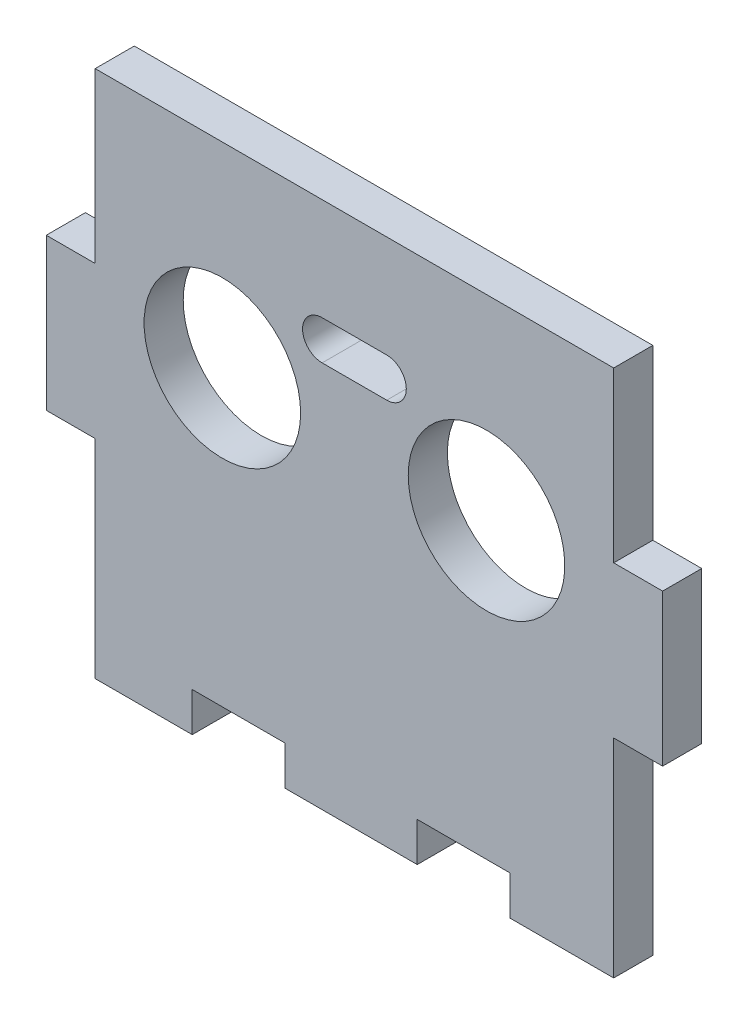
ISO-10303-21;
HEADER;
FILE_DESCRIPTION(('STEP AP214'),'2;1');
FILE_NAME('part.step','',(''),(''),'','','');
FILE_SCHEMA(('AUTOMOTIVE_DESIGN { 1 0 10303 214 1 1 1 1 }'));
ENDSEC;
DATA;
#1=APPLICATION_CONTEXT('core data for automotive mechanical design processes');
#2=APPLICATION_PROTOCOL_DEFINITION('international standard','automotive_design',2000,#1);
#3=PRODUCT_CONTEXT('',#1,'mechanical');
#4=PRODUCT('Part','Part','',(#3));
#5=PRODUCT_RELATED_PRODUCT_CATEGORY('part','',(#4));
#6=PRODUCT_DEFINITION_FORMATION('','',#4);
#7=PRODUCT_DEFINITION_CONTEXT('part definition',#1,'design');
#8=PRODUCT_DEFINITION('design','',#6,#7);
#9=PRODUCT_DEFINITION_SHAPE('','',#8);
#10=(LENGTH_UNIT() NAMED_UNIT(*) SI_UNIT(.MILLI.,.METRE.));
#11=(NAMED_UNIT(*) PLANE_ANGLE_UNIT() SI_UNIT($,.RADIAN.));
#12=(NAMED_UNIT(*) SI_UNIT($,.STERADIAN.) SOLID_ANGLE_UNIT());
#13=UNCERTAINTY_MEASURE_WITH_UNIT(LENGTH_MEASURE(1.E-05),#10,'distance_accuracy_value','');
#14=(GEOMETRIC_REPRESENTATION_CONTEXT(3) GLOBAL_UNCERTAINTY_ASSIGNED_CONTEXT((#13)) GLOBAL_UNIT_ASSIGNED_CONTEXT((#10,
#11,#12)) REPRESENTATION_CONTEXT('',''));
#15=CARTESIAN_POINT('',(0.,0.,0.));
#16=DIRECTION('',(0.,0.,1.));
#17=DIRECTION('',(1.,0.,0.));
#18=AXIS2_PLACEMENT_3D('',#15,#16,#17);
#19=CARTESIAN_POINT('',(0.,0.,4.));
#20=DIRECTION('',(0.,0.,-1.));
#21=DIRECTION('',(-1.,0.,0.));
#22=AXIS2_PLACEMENT_3D('',#19,#20,#21);
#23=PLANE('',#22);
#24=DIRECTION('',(-1.,0.,0.));
#25=VECTOR('',#24,1.);
#26=CARTESIAN_POINT('',(58.,36.75,4.));
#27=LINE('',#26,#25);
#28=CARTESIAN_POINT('',(63.,36.75,4.));
#29=VERTEX_POINT('',#28);
#30=CARTESIAN_POINT('',(58.,36.75,4.));
#31=VERTEX_POINT('',#30);
#32=EDGE_CURVE('E251',#29,#31,#27,.T.);
#33=ORIENTED_EDGE('',*,*,#32,.T.);
#34=DIRECTION('',(0.,1.,0.));
#35=VECTOR('',#34,1.);
#36=CARTESIAN_POINT('',(58.,54.,4.));
#37=LINE('',#36,#35);
#38=CARTESIAN_POINT('',(58.,54.,4.));
#39=VERTEX_POINT('',#38);
#40=EDGE_CURVE('E247',#31,#39,#37,.T.);
#41=ORIENTED_EDGE('',*,*,#40,.T.);
#42=DIRECTION('',(-1.,0.,0.));
#43=VECTOR('',#42,1.);
#44=CARTESIAN_POINT('',(0.,54.,4.));
#45=LINE('',#44,#43);
#46=CARTESIAN_POINT('',(5.,54.,4.));
#47=VERTEX_POINT('',#46);
#48=EDGE_CURVE('E11',#39,#47,#45,.T.);
#49=ORIENTED_EDGE('',*,*,#48,.T.);
#50=DIRECTION('',(0.,1.,0.));
#51=VECTOR('',#50,1.);
#52=CARTESIAN_POINT('',(5.,54.,4.));
#53=LINE('',#52,#51);
#54=CARTESIAN_POINT('',(5.,36.75,4.));
#55=VERTEX_POINT('',#54);
#56=EDGE_CURVE('E289',#55,#47,#53,.T.);
#57=ORIENTED_EDGE('',*,*,#56,.F.);
#58=DIRECTION('',(1.,0.,0.));
#59=VECTOR('',#58,1.);
#60=CARTESIAN_POINT('',(5.,36.75,4.));
#61=LINE('',#60,#59);
#62=CARTESIAN_POINT('',(0.,36.75,4.));
#63=VERTEX_POINT('',#62);
#64=EDGE_CURVE('E286',#63,#55,#61,.T.);
#65=ORIENTED_EDGE('',*,*,#64,.F.);
#66=DIRECTION('',(0.,-1.,0.));
#67=VECTOR('',#66,1.);
#68=CARTESIAN_POINT('',(0.,0.,4.));
#69=LINE('',#68,#67);
#70=CARTESIAN_POINT('',(0.,21.25,4.));
#71=VERTEX_POINT('',#70);
#72=EDGE_CURVE('E369',#63,#71,#69,.T.);
#73=ORIENTED_EDGE('',*,*,#72,.T.);
#74=DIRECTION('',(-1.,0.,0.));
#75=VECTOR('',#74,1.);
#76=CARTESIAN_POINT('',(0.,21.25,4.));
#77=LINE('',#76,#75);
#78=CARTESIAN_POINT('',(5.,21.25,4.));
#79=VERTEX_POINT('',#78);
#80=EDGE_CURVE('E308',#79,#71,#77,.T.);
#81=ORIENTED_EDGE('',*,*,#80,.F.);
#82=DIRECTION('',(0.,1.,0.));
#83=VECTOR('',#82,1.);
#84=CARTESIAN_POINT('',(5.,21.25,4.));
#85=LINE('',#84,#83);
#86=CARTESIAN_POINT('',(5.,0.,4.));
#87=VERTEX_POINT('',#86);
#88=EDGE_CURVE('E305',#87,#79,#85,.T.);
#89=ORIENTED_EDGE('',*,*,#88,.F.);
#90=DIRECTION('',(1.,0.,0.));
#91=VECTOR('',#90,1.);
#92=CARTESIAN_POINT('',(0.,0.,4.));
#93=LINE('',#92,#91);
#94=CARTESIAN_POINT('',(14.9192253852399,0.,4.));
#95=VERTEX_POINT('',#94);
#96=EDGE_CURVE('E373',#87,#95,#93,.T.);
#97=ORIENTED_EDGE('',*,*,#96,.T.);
#98=DIRECTION('',(0.,-1.,0.));
#99=VECTOR('',#98,1.);
#100=CARTESIAN_POINT('',(14.9192253852399,0.,4.));
#101=LINE('',#100,#99);
#102=CARTESIAN_POINT('',(14.9192253852399,4.,4.));
#103=VERTEX_POINT('',#102);
#104=EDGE_CURVE('E329',#103,#95,#101,.T.);
#105=ORIENTED_EDGE('',*,*,#104,.F.);
#106=DIRECTION('',(-1.,0.,0.));
#107=VECTOR('',#106,1.);
#108=CARTESIAN_POINT('',(14.9192253852399,4.,4.));
#109=LINE('',#108,#107);
#110=CARTESIAN_POINT('',(24.4192253852399,4.,4.));
#111=VERTEX_POINT('',#110);
#112=EDGE_CURVE('E326',#111,#103,#109,.T.);
#113=ORIENTED_EDGE('',*,*,#112,.F.);
#114=DIRECTION('',(0.,1.,0.));
#115=VECTOR('',#114,1.);
#116=CARTESIAN_POINT('',(24.4192253852399,4.,4.));
#117=LINE('',#116,#115);
#118=CARTESIAN_POINT('',(24.4192253852399,0.,4.));
#119=VERTEX_POINT('',#118);
#120=EDGE_CURVE('E323',#119,#111,#117,.T.);
#121=ORIENTED_EDGE('',*,*,#120,.F.);
#122=CARTESIAN_POINT('',(37.9192253852399,0.,4.));
#123=VERTEX_POINT('',#122);
#124=EDGE_CURVE('E375',#119,#123,#93,.T.);
#125=ORIENTED_EDGE('',*,*,#124,.T.);
#126=DIRECTION('',(0.,-1.,0.));
#127=VECTOR('',#126,1.);
#128=CARTESIAN_POINT('',(37.9192253852399,0.,4.));
#129=LINE('',#128,#127);
#130=CARTESIAN_POINT('',(37.9192253852399,4.,4.));
#131=VERTEX_POINT('',#130);
#132=EDGE_CURVE('E356',#131,#123,#129,.T.);
#133=ORIENTED_EDGE('',*,*,#132,.F.);
#134=DIRECTION('',(-1.,0.,0.));
#135=VECTOR('',#134,1.);
#136=CARTESIAN_POINT('',(37.9192253852399,4.,4.));
#137=LINE('',#136,#135);
#138=CARTESIAN_POINT('',(47.4192253852399,4.,4.));
#139=VERTEX_POINT('',#138);
#140=EDGE_CURVE('E353',#139,#131,#137,.T.);
#141=ORIENTED_EDGE('',*,*,#140,.F.);
#142=DIRECTION('',(0.,1.,0.));
#143=VECTOR('',#142,1.);
#144=CARTESIAN_POINT('',(47.4192253852399,4.,4.));
#145=LINE('',#144,#143);
#146=CARTESIAN_POINT('',(47.4192253852399,0.,4.));
#147=VERTEX_POINT('',#146);
#148=EDGE_CURVE('E350',#147,#139,#145,.T.);
#149=ORIENTED_EDGE('',*,*,#148,.F.);
#150=CARTESIAN_POINT('',(58.,0.,4.));
#151=VERTEX_POINT('',#150);
#152=EDGE_CURVE('E372',#147,#151,#93,.T.);
#153=ORIENTED_EDGE('',*,*,#152,.T.);
#154=DIRECTION('',(0.,1.,0.));
#155=VECTOR('',#154,1.);
#156=CARTESIAN_POINT('',(58.,21.25,4.));
#157=LINE('',#156,#155);
#158=CARTESIAN_POINT('',(58.,21.25,4.));
#159=VERTEX_POINT('',#158);
#160=EDGE_CURVE('E268',#151,#159,#157,.T.);
#161=ORIENTED_EDGE('',*,*,#160,.T.);
#162=DIRECTION('',(1.,0.,0.));
#163=VECTOR('',#162,1.);
#164=CARTESIAN_POINT('',(63.,21.25,4.));
#165=LINE('',#164,#163);
#166=CARTESIAN_POINT('',(63.,21.25,4.));
#167=VERTEX_POINT('',#166);
#168=EDGE_CURVE('E265',#159,#167,#165,.T.);
#169=ORIENTED_EDGE('',*,*,#168,.T.);
#170=DIRECTION('',(0.,1.,0.));
#171=VECTOR('',#170,1.);
#172=CARTESIAN_POINT('',(63.,0.,4.));
#173=LINE('',#172,#171);
#174=EDGE_CURVE('E42',#167,#29,#173,.T.);
#175=ORIENTED_EDGE('',*,*,#174,.T.);
#176=EDGE_LOOP('',(#33,#41,#49,#57,#65,#73,#81,#89,#97,#105,#113,#121,#125,#133,#141,#149,#153,
#161,#169,#175));
#177=FACE_BOUND('',#176,.T.);
#178=CARTESIAN_POINT('',(18.,34.,4.));
#179=DIRECTION('',(0.,0.,1.));
#180=DIRECTION('',(1.,0.,0.));
#181=AXIS2_PLACEMENT_3D('',#178,#179,#180);
#182=CIRCLE('',#181,8.);
#183=CARTESIAN_POINT('',(26.,34.,4.));
#184=VERTEX_POINT('',#183);
#185=EDGE_CURVE('E226',#184,#184,#182,.T.);
#186=ORIENTED_EDGE('',*,*,#185,.F.);
#187=EDGE_LOOP('',(#186));
#188=FACE_BOUND('',#187,.T.);
#189=DIRECTION('',(-1.,0.,0.));
#190=VECTOR('',#189,1.);
#191=CARTESIAN_POINT('',(31.5,43.55,4.));
#192=LINE('',#191,#190);
#193=CARTESIAN_POINT('',(34.7999999999999,43.55,4.));
#194=VERTEX_POINT('',#193);
#195=CARTESIAN_POINT('',(28.2000000000001,43.55,4.));
#196=VERTEX_POINT('',#195);
#197=EDGE_CURVE('E218',#194,#196,#192,.T.);
#198=ORIENTED_EDGE('',*,*,#197,.F.);
#199=CARTESIAN_POINT('',(34.7999999999999,41.55,4.));
#200=DIRECTION('',(0.,0.,-1.));
#201=DIRECTION('',(-1.,0.,0.));
#202=AXIS2_PLACEMENT_3D('',#199,#200,#201);
#203=CIRCLE('',#202,1.99999999999999);
#204=CARTESIAN_POINT('',(34.7999999999999,39.55,4.));
#205=VERTEX_POINT('',#204);
#206=EDGE_CURVE('E212',#194,#205,#203,.T.);
#207=ORIENTED_EDGE('',*,*,#206,.T.);
#208=DIRECTION('',(1.,0.,0.));
#209=VECTOR('',#208,1.);
#210=CARTESIAN_POINT('',(31.5,39.55,4.));
#211=LINE('',#210,#209);
#212=CARTESIAN_POINT('',(28.2000000000001,39.55,4.));
#213=VERTEX_POINT('',#212);
#214=EDGE_CURVE('E195',#213,#205,#211,.T.);
#215=ORIENTED_EDGE('',*,*,#214,.F.);
#216=CARTESIAN_POINT('',(28.2000000000001,41.55,4.));
#217=DIRECTION('',(0.,0.,1.));
#218=DIRECTION('',(1.,0.,0.));
#219=AXIS2_PLACEMENT_3D('',#216,#217,#218);
#220=CIRCLE('',#219,1.99999999999999);
#221=EDGE_CURVE('E206',#196,#213,#220,.T.);
#222=ORIENTED_EDGE('',*,*,#221,.F.);
#223=EDGE_LOOP('',(#198,#207,#215,#222));
#224=FACE_BOUND('',#223,.T.);
#225=CARTESIAN_POINT('',(45.,34.,4.));
#226=DIRECTION('',(0.,0.,-1.));
#227=DIRECTION('',(-1.,0.,0.));
#228=AXIS2_PLACEMENT_3D('',#225,#226,#227);
#229=CIRCLE('',#228,8.);
#230=CARTESIAN_POINT('',(37.,34.,4.));
#231=VERTEX_POINT('',#230);
#232=EDGE_CURVE('E224',#231,#231,#229,.T.);
#233=ORIENTED_EDGE('',*,*,#232,.T.);
#234=EDGE_LOOP('',(#233));
#235=FACE_BOUND('',#234,.T.);
#236=ADVANCED_FACE('F33',(#177,#188,#224,#235),#23,.F.);
#237=CARTESIAN_POINT('',(0.,0.,0.));
#238=DIRECTION('',(0.,0.,-1.));
#239=DIRECTION('',(-1.,0.,0.));
#240=AXIS2_PLACEMENT_3D('',#237,#238,#239);
#241=PLANE('',#240);
#242=CARTESIAN_POINT('',(34.7999999999999,41.55,0.));
#243=DIRECTION('',(0.,0.,-1.));
#244=DIRECTION('',(-1.,0.,0.));
#245=AXIS2_PLACEMENT_3D('',#242,#243,#244);
#246=CIRCLE('',#245,1.99999999999999);
#247=CARTESIAN_POINT('',(34.7999999999999,43.55,0.));
#248=VERTEX_POINT('',#247);
#249=CARTESIAN_POINT('',(34.7999999999999,39.55,0.));
#250=VERTEX_POINT('',#249);
#251=EDGE_CURVE('E214',#248,#250,#246,.T.);
#252=ORIENTED_EDGE('',*,*,#251,.F.);
#253=DIRECTION('',(-1.,0.,0.));
#254=VECTOR('',#253,1.);
#255=CARTESIAN_POINT('',(31.5,43.55,0.));
#256=LINE('',#255,#254);
#257=CARTESIAN_POINT('',(28.2000000000001,43.55,0.));
#258=VERTEX_POINT('',#257);
#259=EDGE_CURVE('E233',#248,#258,#256,.T.);
#260=ORIENTED_EDGE('',*,*,#259,.T.);
#261=CARTESIAN_POINT('',(28.2000000000001,41.55,0.));
#262=DIRECTION('',(0.,0.,-1.));
#263=DIRECTION('',(-1.,0.,0.));
#264=AXIS2_PLACEMENT_3D('',#261,#262,#263);
#265=CIRCLE('',#264,1.99999999999999);
#266=CARTESIAN_POINT('',(28.2000000000001,39.55,0.));
#267=VERTEX_POINT('',#266);
#268=EDGE_CURVE('E234',#258,#267,#265,.F.);
#269=ORIENTED_EDGE('',*,*,#268,.T.);
#270=DIRECTION('',(1.,0.,0.));
#271=VECTOR('',#270,1.);
#272=CARTESIAN_POINT('',(31.5,39.55,0.));
#273=LINE('',#272,#271);
#274=EDGE_CURVE('E237',#267,#250,#273,.T.);
#275=ORIENTED_EDGE('',*,*,#274,.T.);
#276=EDGE_LOOP('',(#252,#260,#269,#275));
#277=FACE_BOUND('',#276,.T.);
#278=DIRECTION('',(0.,1.,0.));
#279=VECTOR('',#278,1.);
#280=CARTESIAN_POINT('',(58.,54.,0.));
#281=LINE('',#280,#279);
#282=CARTESIAN_POINT('',(58.,36.75,0.));
#283=VERTEX_POINT('',#282);
#284=CARTESIAN_POINT('',(58.,54.,0.));
#285=VERTEX_POINT('',#284);
#286=EDGE_CURVE('E258',#283,#285,#281,.T.);
#287=ORIENTED_EDGE('',*,*,#286,.F.);
#288=DIRECTION('',(-1.,0.,0.));
#289=VECTOR('',#288,1.);
#290=CARTESIAN_POINT('',(58.,36.75,0.));
#291=LINE('',#290,#289);
#292=CARTESIAN_POINT('',(63.,36.75,0.));
#293=VERTEX_POINT('',#292);
#294=EDGE_CURVE('E58',#293,#283,#291,.T.);
#295=ORIENTED_EDGE('',*,*,#294,.F.);
#296=DIRECTION('',(0.,1.,0.));
#297=VECTOR('',#296,1.);
#298=CARTESIAN_POINT('',(63.,0.,0.));
#299=LINE('',#298,#297);
#300=CARTESIAN_POINT('',(63.,21.25,0.));
#301=VERTEX_POINT('',#300);
#302=EDGE_CURVE('E382',#301,#293,#299,.T.);
#303=ORIENTED_EDGE('',*,*,#302,.F.);
#304=DIRECTION('',(1.,0.,0.));
#305=VECTOR('',#304,1.);
#306=CARTESIAN_POINT('',(63.,21.25,0.));
#307=LINE('',#306,#305);
#308=CARTESIAN_POINT('',(58.,21.25,0.));
#309=VERTEX_POINT('',#308);
#310=EDGE_CURVE('E248',#309,#301,#307,.T.);
#311=ORIENTED_EDGE('',*,*,#310,.F.);
#312=DIRECTION('',(0.,1.,0.));
#313=VECTOR('',#312,1.);
#314=CARTESIAN_POINT('',(58.,21.25,0.));
#315=LINE('',#314,#313);
#316=CARTESIAN_POINT('',(58.,0.,0.));
#317=VERTEX_POINT('',#316);
#318=EDGE_CURVE('E229',#317,#309,#315,.T.);
#319=ORIENTED_EDGE('',*,*,#318,.F.);
#320=DIRECTION('',(1.,0.,0.));
#321=VECTOR('',#320,1.);
#322=CARTESIAN_POINT('',(0.,0.,0.));
#323=LINE('',#322,#321);
#324=CARTESIAN_POINT('',(47.4192253852399,0.,0.));
#325=VERTEX_POINT('',#324);
#326=EDGE_CURVE('E380',#325,#317,#323,.T.);
#327=ORIENTED_EDGE('',*,*,#326,.F.);
#328=DIRECTION('',(0.,1.,0.));
#329=VECTOR('',#328,1.);
#330=CARTESIAN_POINT('',(47.4192253852399,4.,0.));
#331=LINE('',#330,#329);
#332=CARTESIAN_POINT('',(47.4192253852399,4.,0.));
#333=VERTEX_POINT('',#332);
#334=EDGE_CURVE('E320',#325,#333,#331,.T.);
#335=ORIENTED_EDGE('',*,*,#334,.T.);
#336=DIRECTION('',(-1.,0.,0.));
#337=VECTOR('',#336,1.);
#338=CARTESIAN_POINT('',(37.9192253852399,4.,0.));
#339=LINE('',#338,#337);
#340=CARTESIAN_POINT('',(37.9192253852399,4.,0.));
#341=VERTEX_POINT('',#340);
#342=EDGE_CURVE('E296',#333,#341,#339,.T.);
#343=ORIENTED_EDGE('',*,*,#342,.T.);
#344=DIRECTION('',(0.,-1.,0.));
#345=VECTOR('',#344,1.);
#346=CARTESIAN_POINT('',(37.9192253852399,0.,0.));
#347=LINE('',#346,#345);
#348=CARTESIAN_POINT('',(37.9192253852399,0.,0.));
#349=VERTEX_POINT('',#348);
#350=EDGE_CURVE('E347',#341,#349,#347,.T.);
#351=ORIENTED_EDGE('',*,*,#350,.T.);
#352=CARTESIAN_POINT('',(24.4192253852399,0.,0.));
#353=VERTEX_POINT('',#352);
#354=EDGE_CURVE('E383',#353,#349,#323,.T.);
#355=ORIENTED_EDGE('',*,*,#354,.F.);
#356=DIRECTION('',(0.,1.,0.));
#357=VECTOR('',#356,1.);
#358=CARTESIAN_POINT('',(24.4192253852399,4.,0.));
#359=LINE('',#358,#357);
#360=CARTESIAN_POINT('',(24.4192253852399,4.,0.));
#361=VERTEX_POINT('',#360);
#362=EDGE_CURVE('E336',#353,#361,#359,.T.);
#363=ORIENTED_EDGE('',*,*,#362,.T.);
#364=DIRECTION('',(-1.,0.,0.));
#365=VECTOR('',#364,1.);
#366=CARTESIAN_POINT('',(14.9192253852399,4.,0.));
#367=LINE('',#366,#365);
#368=CARTESIAN_POINT('',(14.9192253852399,4.,0.));
#369=VERTEX_POINT('',#368);
#370=EDGE_CURVE('E316',#361,#369,#367,.T.);
#371=ORIENTED_EDGE('',*,*,#370,.T.);
#372=DIRECTION('',(0.,-1.,0.));
#373=VECTOR('',#372,1.);
#374=CARTESIAN_POINT('',(14.9192253852399,0.,0.));
#375=LINE('',#374,#373);
#376=CARTESIAN_POINT('',(14.9192253852399,0.,0.));
#377=VERTEX_POINT('',#376);
#378=EDGE_CURVE('E319',#369,#377,#375,.T.);
#379=ORIENTED_EDGE('',*,*,#378,.T.);
#380=CARTESIAN_POINT('',(5.,0.,0.));
#381=VERTEX_POINT('',#380);
#382=EDGE_CURVE('E381',#381,#377,#323,.T.);
#383=ORIENTED_EDGE('',*,*,#382,.F.);
#384=DIRECTION('',(0.,1.,0.));
#385=VECTOR('',#384,1.);
#386=CARTESIAN_POINT('',(5.,21.25,0.));
#387=LINE('',#386,#385);
#388=CARTESIAN_POINT('',(5.,21.25,0.));
#389=VERTEX_POINT('',#388);
#390=EDGE_CURVE('E263',#381,#389,#387,.T.);
#391=ORIENTED_EDGE('',*,*,#390,.T.);
#392=DIRECTION('',(-1.,0.,0.));
#393=VECTOR('',#392,1.);
#394=CARTESIAN_POINT('',(0.,21.25,0.));
#395=LINE('',#394,#393);
#396=CARTESIAN_POINT('',(0.,21.25,0.));
#397=VERTEX_POINT('',#396);
#398=EDGE_CURVE('E302',#389,#397,#395,.T.);
#399=ORIENTED_EDGE('',*,*,#398,.T.);
#400=DIRECTION('',(0.,-1.,0.));
#401=VECTOR('',#400,1.);
#402=CARTESIAN_POINT('',(0.,0.,0.));
#403=LINE('',#402,#401);
#404=CARTESIAN_POINT('',(0.,36.75,0.));
#405=VERTEX_POINT('',#404);
#406=EDGE_CURVE('E344',#405,#397,#403,.T.);
#407=ORIENTED_EDGE('',*,*,#406,.F.);
#408=DIRECTION('',(1.,0.,0.));
#409=VECTOR('',#408,1.);
#410=CARTESIAN_POINT('',(5.,36.75,0.));
#411=LINE('',#410,#409);
#412=CARTESIAN_POINT('',(5.,36.75,0.));
#413=VERTEX_POINT('',#412);
#414=EDGE_CURVE('E279',#405,#413,#411,.T.);
#415=ORIENTED_EDGE('',*,*,#414,.T.);
#416=DIRECTION('',(0.,1.,0.));
#417=VECTOR('',#416,1.);
#418=CARTESIAN_POINT('',(5.,54.,0.));
#419=LINE('',#418,#417);
#420=CARTESIAN_POINT('',(5.,54.,0.));
#421=VERTEX_POINT('',#420);
#422=EDGE_CURVE('E282',#413,#421,#419,.T.);
#423=ORIENTED_EDGE('',*,*,#422,.T.);
#424=DIRECTION('',(-1.,0.,0.));
#425=VECTOR('',#424,1.);
#426=CARTESIAN_POINT('',(0.,54.,0.));
#427=LINE('',#426,#425);
#428=EDGE_CURVE('E37',#285,#421,#427,.T.);
#429=ORIENTED_EDGE('',*,*,#428,.F.);
#430=EDGE_LOOP('',(#287,#295,#303,#311,#319,#327,#335,#343,#351,#355,#363,#371,#379,#383,#391,
#399,#407,#415,#423,#429));
#431=FACE_BOUND('',#430,.T.);
#432=CARTESIAN_POINT('',(18.,34.,0.));
#433=DIRECTION('',(0.,0.,-1.));
#434=DIRECTION('',(-1.,0.,0.));
#435=AXIS2_PLACEMENT_3D('',#432,#433,#434);
#436=CIRCLE('',#435,8.);
#437=CARTESIAN_POINT('',(10.,34.,0.));
#438=VERTEX_POINT('',#437);
#439=EDGE_CURVE('E230',#438,#438,#436,.F.);
#440=ORIENTED_EDGE('',*,*,#439,.T.);
#441=EDGE_LOOP('',(#440));
#442=FACE_BOUND('',#441,.T.);
#443=CARTESIAN_POINT('',(45.,34.,0.));
#444=DIRECTION('',(0.,0.,-1.));
#445=DIRECTION('',(-1.,0.,0.));
#446=AXIS2_PLACEMENT_3D('',#443,#444,#445);
#447=CIRCLE('',#446,8.);
#448=CARTESIAN_POINT('',(37.,34.,0.));
#449=VERTEX_POINT('',#448);
#450=EDGE_CURVE('E238',#449,#449,#447,.T.);
#451=ORIENTED_EDGE('',*,*,#450,.F.);
#452=EDGE_LOOP('',(#451));
#453=FACE_BOUND('',#452,.T.);
#454=ADVANCED_FACE('F400',(#277,#431,#442,#453),#241,.T.);
#455=CARTESIAN_POINT('',(0.,0.,4.));
#456=DIRECTION('',(0.,1.,0.));
#457=DIRECTION('',(0.,0.,1.));
#458=AXIS2_PLACEMENT_3D('',#455,#456,#457);
#459=PLANE('',#458);
#460=DIRECTION('',(0.,0.,1.));
#461=VECTOR('',#460,1.);
#462=CARTESIAN_POINT('',(58.,0.,-0.00100000000000013));
#463=LINE('',#462,#461);
#464=EDGE_CURVE('E272',#317,#151,#463,.T.);
#465=ORIENTED_EDGE('',*,*,#464,.T.);
#466=ORIENTED_EDGE('',*,*,#152,.F.);
#467=DIRECTION('',(0.,0.,1.));
#468=VECTOR('',#467,1.);
#469=CARTESIAN_POINT('',(47.4192253852399,0.,-0.00100000000000013));
#470=LINE('',#469,#468);
#471=EDGE_CURVE('E358',#325,#147,#470,.T.);
#472=ORIENTED_EDGE('',*,*,#471,.F.);
#473=ORIENTED_EDGE('',*,*,#326,.T.);
#474=EDGE_LOOP('',(#465,#466,#472,#473));
#475=FACE_BOUND('',#474,.T.);
#476=ADVANCED_FACE('F432',(#475),#459,.F.);
#477=CARTESIAN_POINT('',(63.,0.,4.));
#478=DIRECTION('',(-1.,0.,0.));
#479=DIRECTION('',(0.,0.,1.));
#480=AXIS2_PLACEMENT_3D('',#477,#478,#479);
#481=PLANE('',#480);
#482=DIRECTION('',(0.,0.,1.));
#483=VECTOR('',#482,1.);
#484=CARTESIAN_POINT('',(63.,36.75,-0.00100000000000013));
#485=LINE('',#484,#483);
#486=EDGE_CURVE('E255',#293,#29,#485,.T.);
#487=ORIENTED_EDGE('',*,*,#486,.T.);
#488=ORIENTED_EDGE('',*,*,#174,.F.);
#489=DIRECTION('',(0.,0.,1.));
#490=VECTOR('',#489,1.);
#491=CARTESIAN_POINT('',(63.,21.25,-0.00100000000000013));
#492=LINE('',#491,#490);
#493=EDGE_CURVE('E271',#301,#167,#492,.T.);
#494=ORIENTED_EDGE('',*,*,#493,.F.);
#495=ORIENTED_EDGE('',*,*,#302,.T.);
#496=EDGE_LOOP('',(#487,#488,#494,#495));
#497=FACE_BOUND('',#496,.T.);
#498=ADVANCED_FACE('F425',(#497),#481,.F.);
#499=CARTESIAN_POINT('',(0.,54.,4.));
#500=DIRECTION('',(0.,-1.,0.));
#501=DIRECTION('',(0.,0.,-1.));
#502=AXIS2_PLACEMENT_3D('',#499,#500,#501);
#503=PLANE('',#502);
#504=DIRECTION('',(0.,0.,1.));
#505=VECTOR('',#504,1.);
#506=CARTESIAN_POINT('',(58.,54.,-0.00100000000000013));
#507=LINE('',#506,#505);
#508=EDGE_CURVE('E254',#285,#39,#507,.T.);
#509=ORIENTED_EDGE('',*,*,#508,.F.);
#510=ORIENTED_EDGE('',*,*,#428,.T.);
#511=DIRECTION('',(0.,0.,1.));
#512=VECTOR('',#511,1.);
#513=CARTESIAN_POINT('',(5.,54.,-0.00100000000000013));
#514=LINE('',#513,#512);
#515=EDGE_CURVE('E293',#421,#47,#514,.T.);
#516=ORIENTED_EDGE('',*,*,#515,.T.);
#517=ORIENTED_EDGE('',*,*,#48,.F.);
#518=EDGE_LOOP('',(#509,#510,#516,#517));
#519=FACE_BOUND('',#518,.T.);
#520=ADVANCED_FACE('F392',(#519),#503,.F.);
#521=ORIENTED_EDGE('',*,*,#96,.F.);
#522=DIRECTION('',(0.,0.,1.));
#523=VECTOR('',#522,1.);
#524=CARTESIAN_POINT('',(5.,0.,-0.00100000000000013));
#525=LINE('',#524,#523);
#526=EDGE_CURVE('E310',#381,#87,#525,.T.);
#527=ORIENTED_EDGE('',*,*,#526,.F.);
#528=ORIENTED_EDGE('',*,*,#382,.T.);
#529=DIRECTION('',(0.,0.,1.));
#530=VECTOR('',#529,1.);
#531=CARTESIAN_POINT('',(14.9192253852399,0.,-0.00100000000000013));
#532=LINE('',#531,#530);
#533=EDGE_CURVE('E333',#377,#95,#532,.T.);
#534=ORIENTED_EDGE('',*,*,#533,.T.);
#535=EDGE_LOOP('',(#521,#527,#528,#534));
#536=FACE_BOUND('',#535,.T.);
#537=ADVANCED_FACE('F464',(#536),#459,.F.);
#538=ORIENTED_EDGE('',*,*,#124,.F.);
#539=DIRECTION('',(0.,0.,1.));
#540=VECTOR('',#539,1.);
#541=CARTESIAN_POINT('',(24.4192253852399,0.,-0.00100000000000013));
#542=LINE('',#541,#540);
#543=EDGE_CURVE('E332',#353,#119,#542,.T.);
#544=ORIENTED_EDGE('',*,*,#543,.F.);
#545=ORIENTED_EDGE('',*,*,#354,.T.);
#546=DIRECTION('',(0.,0.,1.));
#547=VECTOR('',#546,1.);
#548=CARTESIAN_POINT('',(37.9192253852399,0.,-0.00100000000000013));
#549=LINE('',#548,#547);
#550=EDGE_CURVE('E359',#349,#123,#549,.T.);
#551=ORIENTED_EDGE('',*,*,#550,.T.);
#552=EDGE_LOOP('',(#538,#544,#545,#551));
#553=FACE_BOUND('',#552,.T.);
#554=ADVANCED_FACE('F439',(#553),#459,.F.);
#555=CARTESIAN_POINT('',(0.,0.,4.));
#556=DIRECTION('',(1.,0.,0.));
#557=DIRECTION('',(0.,0.,-1.));
#558=AXIS2_PLACEMENT_3D('',#555,#556,#557);
#559=PLANE('',#558);
#560=ORIENTED_EDGE('',*,*,#72,.F.);
#561=DIRECTION('',(0.,0.,1.));
#562=VECTOR('',#561,1.);
#563=CARTESIAN_POINT('',(0.,36.75,-0.00100000000000013));
#564=LINE('',#563,#562);
#565=EDGE_CURVE('E292',#405,#63,#564,.T.);
#566=ORIENTED_EDGE('',*,*,#565,.F.);
#567=ORIENTED_EDGE('',*,*,#406,.T.);
#568=DIRECTION('',(0.,0.,1.));
#569=VECTOR('',#568,1.);
#570=CARTESIAN_POINT('',(0.,21.25,-0.00100000000000013));
#571=LINE('',#570,#569);
#572=EDGE_CURVE('E283',#397,#71,#571,.T.);
#573=ORIENTED_EDGE('',*,*,#572,.T.);
#574=EDGE_LOOP('',(#560,#566,#567,#573));
#575=FACE_BOUND('',#574,.T.);
#576=ADVANCED_FACE('F35',(#575),#559,.F.);
#577=CARTESIAN_POINT('',(37.9192253852399,0.,-0.00100000000000013));
#578=DIRECTION('',(-1.,0.,0.));
#579=DIRECTION('',(0.,-1.,0.));
#580=AXIS2_PLACEMENT_3D('',#577,#578,#579);
#581=PLANE('',#580);
#582=DIRECTION('',(0.,0.,1.));
#583=VECTOR('',#582,1.);
#584=CARTESIAN_POINT('',(37.9192253852399,4.,-0.00100000000000013));
#585=LINE('',#584,#583);
#586=EDGE_CURVE('E362',#341,#131,#585,.T.);
#587=ORIENTED_EDGE('',*,*,#586,.T.);
#588=ORIENTED_EDGE('',*,*,#132,.T.);
#589=ORIENTED_EDGE('',*,*,#550,.F.);
#590=ORIENTED_EDGE('',*,*,#350,.F.);
#591=EDGE_LOOP('',(#587,#588,#589,#590));
#592=FACE_BOUND('',#591,.T.);
#593=ADVANCED_FACE('F444',(#592),#581,.F.);
#594=CARTESIAN_POINT('',(37.9192253852399,4.,-0.00100000000000013));
#595=DIRECTION('',(0.,1.,0.));
#596=DIRECTION('',(0.,0.,1.));
#597=AXIS2_PLACEMENT_3D('',#594,#595,#596);
#598=PLANE('',#597);
#599=DIRECTION('',(0.,0.,1.));
#600=VECTOR('',#599,1.);
#601=CARTESIAN_POINT('',(47.4192253852399,4.,-0.00100000000000013));
#602=LINE('',#601,#600);
#603=EDGE_CURVE('E364',#333,#139,#602,.T.);
#604=ORIENTED_EDGE('',*,*,#603,.T.);
#605=ORIENTED_EDGE('',*,*,#140,.T.);
#606=ORIENTED_EDGE('',*,*,#586,.F.);
#607=ORIENTED_EDGE('',*,*,#342,.F.);
#608=EDGE_LOOP('',(#604,#605,#606,#607));
#609=FACE_BOUND('',#608,.T.);
#610=ADVANCED_FACE('F446',(#609),#598,.F.);
#611=CARTESIAN_POINT('',(47.4192253852399,4.,-0.00100000000000013));
#612=DIRECTION('',(1.,0.,0.));
#613=DIRECTION('',(0.,1.,0.));
#614=AXIS2_PLACEMENT_3D('',#611,#612,#613);
#615=PLANE('',#614);
#616=ORIENTED_EDGE('',*,*,#471,.T.);
#617=ORIENTED_EDGE('',*,*,#148,.T.);
#618=ORIENTED_EDGE('',*,*,#603,.F.);
#619=ORIENTED_EDGE('',*,*,#334,.F.);
#620=EDGE_LOOP('',(#616,#617,#618,#619));
#621=FACE_BOUND('',#620,.T.);
#622=ADVANCED_FACE('F488',(#621),#615,.F.);
#623=CARTESIAN_POINT('',(14.9192253852399,0.,-0.00100000000000013));
#624=DIRECTION('',(-1.,0.,0.));
#625=DIRECTION('',(0.,0.,1.));
#626=AXIS2_PLACEMENT_3D('',#623,#624,#625);
#627=PLANE('',#626);
#628=DIRECTION('',(0.,0.,1.));
#629=VECTOR('',#628,1.);
#630=CARTESIAN_POINT('',(14.9192253852399,4.,-0.00100000000000013));
#631=LINE('',#630,#629);
#632=EDGE_CURVE('E337',#369,#103,#631,.T.);
#633=ORIENTED_EDGE('',*,*,#632,.T.);
#634=ORIENTED_EDGE('',*,*,#104,.T.);
#635=ORIENTED_EDGE('',*,*,#533,.F.);
#636=ORIENTED_EDGE('',*,*,#378,.F.);
#637=EDGE_LOOP('',(#633,#634,#635,#636));
#638=FACE_BOUND('',#637,.T.);
#639=ADVANCED_FACE('F461',(#638),#627,.F.);
#640=CARTESIAN_POINT('',(14.9192253852399,4.,-0.00100000000000013));
#641=DIRECTION('',(0.,1.,0.));
#642=DIRECTION('',(0.,0.,1.));
#643=AXIS2_PLACEMENT_3D('',#640,#641,#642);
#644=PLANE('',#643);
#645=DIRECTION('',(0.,0.,1.));
#646=VECTOR('',#645,1.);
#647=CARTESIAN_POINT('',(24.4192253852399,4.,-0.00100000000000013));
#648=LINE('',#647,#646);
#649=EDGE_CURVE('E339',#361,#111,#648,.T.);
#650=ORIENTED_EDGE('',*,*,#649,.T.);
#651=ORIENTED_EDGE('',*,*,#112,.T.);
#652=ORIENTED_EDGE('',*,*,#632,.F.);
#653=ORIENTED_EDGE('',*,*,#370,.F.);
#654=EDGE_LOOP('',(#650,#651,#652,#653));
#655=FACE_BOUND('',#654,.T.);
#656=ADVANCED_FACE('F457',(#655),#644,.F.);
#657=CARTESIAN_POINT('',(24.4192253852399,4.,-0.00100000000000013));
#658=DIRECTION('',(1.,0.,0.));
#659=DIRECTION('',(0.,1.,0.));
#660=AXIS2_PLACEMENT_3D('',#657,#658,#659);
#661=PLANE('',#660);
#662=ORIENTED_EDGE('',*,*,#543,.T.);
#663=ORIENTED_EDGE('',*,*,#120,.T.);
#664=ORIENTED_EDGE('',*,*,#649,.F.);
#665=ORIENTED_EDGE('',*,*,#362,.F.);
#666=EDGE_LOOP('',(#662,#663,#664,#665));
#667=FACE_BOUND('',#666,.T.);
#668=ADVANCED_FACE('F453',(#667),#661,.F.);
#669=CARTESIAN_POINT('',(0.,21.25,-0.00100000000000013));
#670=DIRECTION('',(0.,1.,0.));
#671=DIRECTION('',(0.,0.,1.));
#672=AXIS2_PLACEMENT_3D('',#669,#670,#671);
#673=PLANE('',#672);
#674=DIRECTION('',(0.,0.,1.));
#675=VECTOR('',#674,1.);
#676=CARTESIAN_POINT('',(5.,21.25,-0.00100000000000013));
#677=LINE('',#676,#675);
#678=EDGE_CURVE('E313',#389,#79,#677,.T.);
#679=ORIENTED_EDGE('',*,*,#678,.T.);
#680=ORIENTED_EDGE('',*,*,#80,.T.);
#681=ORIENTED_EDGE('',*,*,#572,.F.);
#682=ORIENTED_EDGE('',*,*,#398,.F.);
#683=EDGE_LOOP('',(#679,#680,#681,#682));
#684=FACE_BOUND('',#683,.T.);
#685=ADVANCED_FACE('F470',(#684),#673,.F.);
#686=CARTESIAN_POINT('',(5.,21.25,-0.00100000000000013));
#687=DIRECTION('',(1.,0.,0.));
#688=DIRECTION('',(0.,1.,0.));
#689=AXIS2_PLACEMENT_3D('',#686,#687,#688);
#690=PLANE('',#689);
#691=ORIENTED_EDGE('',*,*,#526,.T.);
#692=ORIENTED_EDGE('',*,*,#88,.T.);
#693=ORIENTED_EDGE('',*,*,#678,.F.);
#694=ORIENTED_EDGE('',*,*,#390,.F.);
#695=EDGE_LOOP('',(#691,#692,#693,#694));
#696=FACE_BOUND('',#695,.T.);
#697=ADVANCED_FACE('F467',(#696),#690,.F.);
#698=CARTESIAN_POINT('',(5.,54.,-0.00100000000000013));
#699=DIRECTION('',(1.,0.,0.));
#700=DIRECTION('',(0.,1.,0.));
#701=AXIS2_PLACEMENT_3D('',#698,#699,#700);
#702=PLANE('',#701);
#703=DIRECTION('',(0.,0.,1.));
#704=VECTOR('',#703,1.);
#705=CARTESIAN_POINT('',(5.,36.75,-0.00100000000000013));
#706=LINE('',#705,#704);
#707=EDGE_CURVE('E297',#413,#55,#706,.T.);
#708=ORIENTED_EDGE('',*,*,#707,.T.);
#709=ORIENTED_EDGE('',*,*,#56,.T.);
#710=ORIENTED_EDGE('',*,*,#515,.F.);
#711=ORIENTED_EDGE('',*,*,#422,.F.);
#712=EDGE_LOOP('',(#708,#709,#710,#711));
#713=FACE_BOUND('',#712,.T.);
#714=ADVANCED_FACE('F398',(#713),#702,.F.);
#715=CARTESIAN_POINT('',(5.,36.75,-0.00100000000000013));
#716=DIRECTION('',(0.,-1.,0.));
#717=DIRECTION('',(0.,0.,-1.));
#718=AXIS2_PLACEMENT_3D('',#715,#716,#717);
#719=PLANE('',#718);
#720=ORIENTED_EDGE('',*,*,#565,.T.);
#721=ORIENTED_EDGE('',*,*,#64,.T.);
#722=ORIENTED_EDGE('',*,*,#707,.F.);
#723=ORIENTED_EDGE('',*,*,#414,.F.);
#724=EDGE_LOOP('',(#720,#721,#722,#723));
#725=FACE_BOUND('',#724,.T.);
#726=ADVANCED_FACE('F405',(#725),#719,.F.);
#727=CARTESIAN_POINT('',(58.,21.25,-0.00100000000000013));
#728=DIRECTION('',(1.,0.,0.));
#729=DIRECTION('',(0.,1.,0.));
#730=AXIS2_PLACEMENT_3D('',#727,#728,#729);
#731=PLANE('',#730);
#732=ORIENTED_EDGE('',*,*,#318,.T.);
#733=DIRECTION('',(0.,0.,1.));
#734=VECTOR('',#733,1.);
#735=CARTESIAN_POINT('',(58.,21.25,-0.00100000000000013));
#736=LINE('',#735,#734);
#737=EDGE_CURVE('E275',#309,#159,#736,.T.);
#738=ORIENTED_EDGE('',*,*,#737,.T.);
#739=ORIENTED_EDGE('',*,*,#160,.F.);
#740=ORIENTED_EDGE('',*,*,#464,.F.);
#741=EDGE_LOOP('',(#732,#738,#739,#740));
#742=FACE_BOUND('',#741,.T.);
#743=ADVANCED_FACE('F430',(#742),#731,.T.);
#744=CARTESIAN_POINT('',(63.,21.25,-0.00100000000000013));
#745=DIRECTION('',(0.,-1.,0.));
#746=DIRECTION('',(0.,0.,-1.));
#747=AXIS2_PLACEMENT_3D('',#744,#745,#746);
#748=PLANE('',#747);
#749=ORIENTED_EDGE('',*,*,#310,.T.);
#750=ORIENTED_EDGE('',*,*,#493,.T.);
#751=ORIENTED_EDGE('',*,*,#168,.F.);
#752=ORIENTED_EDGE('',*,*,#737,.F.);
#753=EDGE_LOOP('',(#749,#750,#751,#752));
#754=FACE_BOUND('',#753,.T.);
#755=ADVANCED_FACE('F422',(#754),#748,.T.);
#756=CARTESIAN_POINT('',(58.,36.75,-0.00100000000000013));
#757=DIRECTION('',(0.,1.,0.));
#758=DIRECTION('',(0.,0.,1.));
#759=AXIS2_PLACEMENT_3D('',#756,#757,#758);
#760=PLANE('',#759);
#761=ORIENTED_EDGE('',*,*,#294,.T.);
#762=DIRECTION('',(0.,0.,1.));
#763=VECTOR('',#762,1.);
#764=CARTESIAN_POINT('',(58.,36.75,-0.00100000000000013));
#765=LINE('',#764,#763);
#766=EDGE_CURVE('E259',#283,#31,#765,.T.);
#767=ORIENTED_EDGE('',*,*,#766,.T.);
#768=ORIENTED_EDGE('',*,*,#32,.F.);
#769=ORIENTED_EDGE('',*,*,#486,.F.);
#770=EDGE_LOOP('',(#761,#767,#768,#769));
#771=FACE_BOUND('',#770,.T.);
#772=ADVANCED_FACE('F603',(#771),#760,.T.);
#773=CARTESIAN_POINT('',(58.,54.,-0.00100000000000013));
#774=DIRECTION('',(1.,0.,0.));
#775=DIRECTION('',(0.,1.,0.));
#776=AXIS2_PLACEMENT_3D('',#773,#774,#775);
#777=PLANE('',#776);
#778=ORIENTED_EDGE('',*,*,#286,.T.);
#779=ORIENTED_EDGE('',*,*,#508,.T.);
#780=ORIENTED_EDGE('',*,*,#40,.F.);
#781=ORIENTED_EDGE('',*,*,#766,.F.);
#782=EDGE_LOOP('',(#778,#779,#780,#781));
#783=FACE_BOUND('',#782,.T.);
#784=ADVANCED_FACE('F415',(#783),#777,.T.);
#785=CARTESIAN_POINT('',(31.5,39.55,-0.00100000000000013));
#786=DIRECTION('',(0.,-1.,0.));
#787=DIRECTION('',(1.,0.,0.));
#788=AXIS2_PLACEMENT_3D('',#785,#786,#787);
#789=PLANE('',#788);
#790=DIRECTION('',(0.,0.,1.));
#791=VECTOR('',#790,1.);
#792=CARTESIAN_POINT('',(28.2000000000001,39.55,-0.00100000000000013));
#793=LINE('',#792,#791);
#794=EDGE_CURVE('E201',#267,#213,#793,.T.);
#795=ORIENTED_EDGE('',*,*,#794,.T.);
#796=ORIENTED_EDGE('',*,*,#214,.T.);
#797=DIRECTION('',(0.,0.,1.));
#798=VECTOR('',#797,1.);
#799=CARTESIAN_POINT('',(34.7999999999999,39.55,-0.00100000000000013));
#800=LINE('',#799,#798);
#801=EDGE_CURVE('E198',#250,#205,#800,.T.);
#802=ORIENTED_EDGE('',*,*,#801,.F.);
#803=ORIENTED_EDGE('',*,*,#274,.F.);
#804=EDGE_LOOP('',(#795,#796,#802,#803));
#805=FACE_BOUND('',#804,.T.);
#806=ADVANCED_FACE('F197',(#805),#789,.F.);
#807=CARTESIAN_POINT('',(28.2000000000001,41.55,-0.00100000000000013));
#808=DIRECTION('',(0.,0.,1.));
#809=DIRECTION('',(1.,0.,0.));
#810=AXIS2_PLACEMENT_3D('',#807,#808,#809);
#811=CYLINDRICAL_SURFACE('',#810,1.99999999999999);
#812=DIRECTION('',(0.,0.,1.));
#813=VECTOR('',#812,1.);
#814=CARTESIAN_POINT('',(28.2000000000001,43.55,-0.00100000000000013));
#815=LINE('',#814,#813);
#816=EDGE_CURVE('E50',#258,#196,#815,.T.);
#817=ORIENTED_EDGE('',*,*,#816,.T.);
#818=ORIENTED_EDGE('',*,*,#221,.T.);
#819=ORIENTED_EDGE('',*,*,#794,.F.);
#820=ORIENTED_EDGE('',*,*,#268,.F.);
#821=EDGE_LOOP('',(#817,#818,#819,#820));
#822=FACE_BOUND('',#821,.T.);
#823=ADVANCED_FACE('F626',(#822),#811,.F.);
#824=CARTESIAN_POINT('',(31.5,43.55,-0.00100000000000013));
#825=DIRECTION('',(0.,1.,0.));
#826=DIRECTION('',(-1.,0.,0.));
#827=AXIS2_PLACEMENT_3D('',#824,#825,#826);
#828=PLANE('',#827);
#829=ORIENTED_EDGE('',*,*,#259,.F.);
#830=DIRECTION('',(0.,0.,1.));
#831=VECTOR('',#830,1.);
#832=CARTESIAN_POINT('',(34.7999999999999,43.55,-0.00100000000000013));
#833=LINE('',#832,#831);
#834=EDGE_CURVE('E215',#248,#194,#833,.T.);
#835=ORIENTED_EDGE('',*,*,#834,.T.);
#836=ORIENTED_EDGE('',*,*,#197,.T.);
#837=ORIENTED_EDGE('',*,*,#816,.F.);
#838=EDGE_LOOP('',(#829,#835,#836,#837));
#839=FACE_BOUND('',#838,.T.);
#840=ADVANCED_FACE('F631',(#839),#828,.F.);
#841=CARTESIAN_POINT('',(18.,34.,-0.00100000000000013));
#842=DIRECTION('',(0.,0.,1.));
#843=DIRECTION('',(1.,0.,0.));
#844=AXIS2_PLACEMENT_3D('',#841,#842,#843);
#845=CYLINDRICAL_SURFACE('',#844,8.);
#846=ORIENTED_EDGE('',*,*,#439,.F.);
#847=EDGE_LOOP('',(#846));
#848=FACE_BOUND('',#847,.T.);
#849=ORIENTED_EDGE('',*,*,#185,.T.);
#850=EDGE_LOOP('',(#849));
#851=FACE_BOUND('',#850,.T.);
#852=ADVANCED_FACE('F639',(#848,#851),#845,.F.);
#853=CARTESIAN_POINT('',(34.7999999999999,41.55,-0.00100000000000013));
#854=DIRECTION('',(0.,0.,1.));
#855=DIRECTION('',(1.,0.,0.));
#856=AXIS2_PLACEMENT_3D('',#853,#854,#855);
#857=CYLINDRICAL_SURFACE('',#856,1.99999999999999);
#858=ORIENTED_EDGE('',*,*,#251,.T.);
#859=ORIENTED_EDGE('',*,*,#801,.T.);
#860=ORIENTED_EDGE('',*,*,#206,.F.);
#861=ORIENTED_EDGE('',*,*,#834,.F.);
#862=EDGE_LOOP('',(#858,#859,#860,#861));
#863=FACE_BOUND('',#862,.T.);
#864=ADVANCED_FACE('F210',(#863),#857,.F.);
#865=CARTESIAN_POINT('',(45.,34.,-0.00100000000000013));
#866=DIRECTION('',(0.,0.,1.));
#867=DIRECTION('',(1.,0.,0.));
#868=AXIS2_PLACEMENT_3D('',#865,#866,#867);
#869=CYLINDRICAL_SURFACE('',#868,8.);
#870=ORIENTED_EDGE('',*,*,#450,.T.);
#871=EDGE_LOOP('',(#870));
#872=FACE_BOUND('',#871,.T.);
#873=ORIENTED_EDGE('',*,*,#232,.F.);
#874=EDGE_LOOP('',(#873));
#875=FACE_BOUND('',#874,.T.);
#876=ADVANCED_FACE('F677',(#872,#875),#869,.F.);
#877=CLOSED_SHELL('',(#236,#454,#476,#498,#520,#537,#554,#576,#593,#610,#622,#639,#656,#668,
#685,#697,#714,#726,#743,#755,#772,#784,#806,#823,#840,#852,#864,#876));
#878=MANIFOLD_SOLID_BREP('B2',#877);
#879=ADVANCED_BREP_SHAPE_REPRESENTATION('',(#18,#878),#14);
#880=SHAPE_DEFINITION_REPRESENTATION(#9,#879);
ENDSEC;
END-ISO-10303-21;
